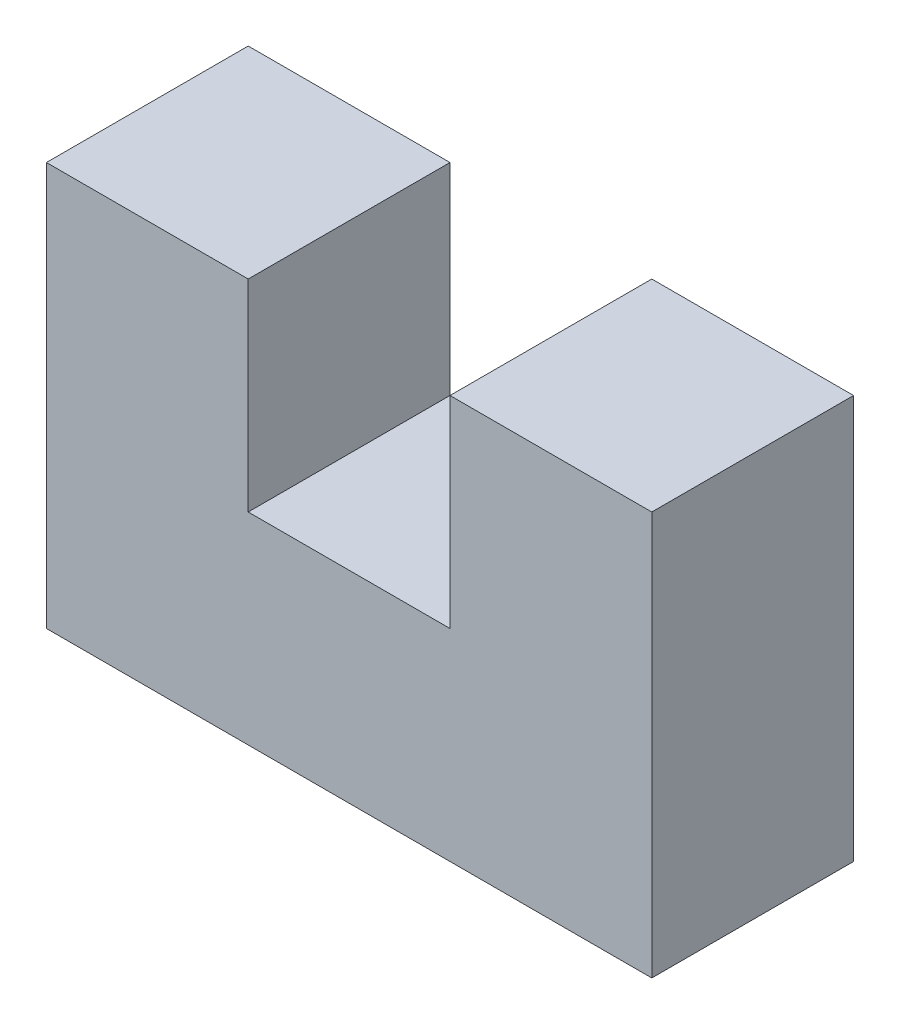
ISO-10303-21;
HEADER;
FILE_DESCRIPTION(('STEP AP214'),'2;1');
FILE_NAME('part.step','',(''),(''),'','','');
FILE_SCHEMA(('AUTOMOTIVE_DESIGN { 1 0 10303 214 1 1 1 1 }'));
ENDSEC;
DATA;
#1=APPLICATION_CONTEXT('core data for automotive mechanical design processes');
#2=APPLICATION_PROTOCOL_DEFINITION('international standard','automotive_design',2000,#1);
#3=PRODUCT_CONTEXT('',#1,'mechanical');
#4=PRODUCT('Part','Part','',(#3));
#5=PRODUCT_RELATED_PRODUCT_CATEGORY('part','',(#4));
#6=PRODUCT_DEFINITION_FORMATION('','',#4);
#7=PRODUCT_DEFINITION_CONTEXT('part definition',#1,'design');
#8=PRODUCT_DEFINITION('design','',#6,#7);
#9=PRODUCT_DEFINITION_SHAPE('','',#8);
#10=(LENGTH_UNIT() NAMED_UNIT(*) SI_UNIT(.MILLI.,.METRE.));
#11=(NAMED_UNIT(*) PLANE_ANGLE_UNIT() SI_UNIT($,.RADIAN.));
#12=(NAMED_UNIT(*) SI_UNIT($,.STERADIAN.) SOLID_ANGLE_UNIT());
#13=UNCERTAINTY_MEASURE_WITH_UNIT(LENGTH_MEASURE(1.E-05),#10,'distance_accuracy_value','');
#14=(GEOMETRIC_REPRESENTATION_CONTEXT(3) GLOBAL_UNCERTAINTY_ASSIGNED_CONTEXT((#13)) GLOBAL_UNIT_ASSIGNED_CONTEXT((#10,
#11,#12)) REPRESENTATION_CONTEXT('',''));
#15=CARTESIAN_POINT('',(0.,0.,0.));
#16=DIRECTION('',(0.,0.,1.));
#17=DIRECTION('',(1.,0.,0.));
#18=AXIS2_PLACEMENT_3D('',#15,#16,#17);
#19=CARTESIAN_POINT('',(25.4,50.8,25.4));
#20=DIRECTION('',(0.,-1.,0.));
#21=DIRECTION('',(0.,0.,-1.));
#22=AXIS2_PLACEMENT_3D('',#19,#20,#21);
#23=PLANE('',#22);
#24=DIRECTION('',(-1.,0.,0.));
#25=VECTOR('',#24,1.);
#26=CARTESIAN_POINT('',(25.4,50.8,0.));
#27=LINE('',#26,#25);
#28=CARTESIAN_POINT('',(25.4,50.8,0.));
#29=VERTEX_POINT('',#28);
#30=CARTESIAN_POINT('',(0.,50.8,0.));
#31=VERTEX_POINT('',#30);
#32=EDGE_CURVE('E133',#29,#31,#27,.T.);
#33=ORIENTED_EDGE('',*,*,#32,.T.);
#34=DIRECTION('',(0.,0.,-1.));
#35=VECTOR('',#34,1.);
#36=CARTESIAN_POINT('',(0.,50.8,25.4));
#37=LINE('',#36,#35);
#38=CARTESIAN_POINT('',(0.,50.8,25.4));
#39=VERTEX_POINT('',#38);
#40=EDGE_CURVE('E11',#39,#31,#37,.T.);
#41=ORIENTED_EDGE('',*,*,#40,.F.);
#42=DIRECTION('',(-1.,0.,0.));
#43=VECTOR('',#42,1.);
#44=CARTESIAN_POINT('',(25.4,50.8,25.4));
#45=LINE('',#44,#43);
#46=CARTESIAN_POINT('',(25.4,50.8,25.4));
#47=VERTEX_POINT('',#46);
#48=EDGE_CURVE('E147',#47,#39,#45,.T.);
#49=ORIENTED_EDGE('',*,*,#48,.F.);
#50=DIRECTION('',(0.,0.,-1.));
#51=VECTOR('',#50,1.);
#52=CARTESIAN_POINT('',(25.4,50.8,25.4));
#53=LINE('',#52,#51);
#54=EDGE_CURVE('E129',#47,#29,#53,.T.);
#55=ORIENTED_EDGE('',*,*,#54,.T.);
#56=EDGE_LOOP('',(#33,#41,#49,#55));
#57=FACE_BOUND('',#56,.T.);
#58=ADVANCED_FACE('F37',(#57),#23,.F.);
#59=CARTESIAN_POINT('',(0.,50.8,25.4));
#60=DIRECTION('',(1.,0.,0.));
#61=DIRECTION('',(0.,0.,-1.));
#62=AXIS2_PLACEMENT_3D('',#59,#60,#61);
#63=PLANE('',#62);
#64=DIRECTION('',(0.,-1.,0.));
#65=VECTOR('',#64,1.);
#66=CARTESIAN_POINT('',(0.,50.8,0.));
#67=LINE('',#66,#65);
#68=CARTESIAN_POINT('',(0.,0.,0.));
#69=VERTEX_POINT('',#68);
#70=EDGE_CURVE('E136',#31,#69,#67,.T.);
#71=ORIENTED_EDGE('',*,*,#70,.T.);
#72=DIRECTION('',(0.,0.,-1.));
#73=VECTOR('',#72,1.);
#74=CARTESIAN_POINT('',(0.,0.,25.4));
#75=LINE('',#74,#73);
#76=CARTESIAN_POINT('',(0.,0.,25.4));
#77=VERTEX_POINT('',#76);
#78=EDGE_CURVE('E45',#77,#69,#75,.T.);
#79=ORIENTED_EDGE('',*,*,#78,.F.);
#80=DIRECTION('',(0.,-1.,0.));
#81=VECTOR('',#80,1.);
#82=CARTESIAN_POINT('',(0.,50.8,25.4));
#83=LINE('',#82,#81);
#84=EDGE_CURVE('E96',#39,#77,#83,.T.);
#85=ORIENTED_EDGE('',*,*,#84,.F.);
#86=ORIENTED_EDGE('',*,*,#40,.T.);
#87=EDGE_LOOP('',(#71,#79,#85,#86));
#88=FACE_BOUND('',#87,.T.);
#89=ADVANCED_FACE('F182',(#88),#63,.F.);
#90=CARTESIAN_POINT('',(0.,0.,25.4));
#91=DIRECTION('',(0.,1.,0.));
#92=DIRECTION('',(0.,0.,1.));
#93=AXIS2_PLACEMENT_3D('',#90,#91,#92);
#94=PLANE('',#93);
#95=DIRECTION('',(1.,0.,0.));
#96=VECTOR('',#95,1.);
#97=CARTESIAN_POINT('',(0.,0.,0.));
#98=LINE('',#97,#96);
#99=CARTESIAN_POINT('',(76.2,0.,0.));
#100=VERTEX_POINT('',#99);
#101=EDGE_CURVE('E138',#69,#100,#98,.T.);
#102=ORIENTED_EDGE('',*,*,#101,.T.);
#103=DIRECTION('',(0.,0.,-1.));
#104=VECTOR('',#103,1.);
#105=CARTESIAN_POINT('',(76.2,0.,25.4));
#106=LINE('',#105,#104);
#107=CARTESIAN_POINT('',(76.2,0.,25.4));
#108=VERTEX_POINT('',#107);
#109=EDGE_CURVE('E154',#108,#100,#106,.T.);
#110=ORIENTED_EDGE('',*,*,#109,.F.);
#111=DIRECTION('',(1.,0.,0.));
#112=VECTOR('',#111,1.);
#113=CARTESIAN_POINT('',(0.,0.,25.4));
#114=LINE('',#113,#112);
#115=EDGE_CURVE('E162',#77,#108,#114,.T.);
#116=ORIENTED_EDGE('',*,*,#115,.F.);
#117=ORIENTED_EDGE('',*,*,#78,.T.);
#118=EDGE_LOOP('',(#102,#110,#116,#117));
#119=FACE_BOUND('',#118,.T.);
#120=ADVANCED_FACE('F160',(#119),#94,.F.);
#121=CARTESIAN_POINT('',(76.2,0.,25.4));
#122=DIRECTION('',(-1.,0.,0.));
#123=DIRECTION('',(0.,0.,1.));
#124=AXIS2_PLACEMENT_3D('',#121,#122,#123);
#125=PLANE('',#124);
#126=DIRECTION('',(0.,1.,0.));
#127=VECTOR('',#126,1.);
#128=CARTESIAN_POINT('',(76.2,0.,0.));
#129=LINE('',#128,#127);
#130=CARTESIAN_POINT('',(76.2,50.8,0.));
#131=VERTEX_POINT('',#130);
#132=EDGE_CURVE('E140',#100,#131,#129,.T.);
#133=ORIENTED_EDGE('',*,*,#132,.T.);
#134=DIRECTION('',(0.,0.,-1.));
#135=VECTOR('',#134,1.);
#136=CARTESIAN_POINT('',(76.2,50.8,25.4));
#137=LINE('',#136,#135);
#138=CARTESIAN_POINT('',(76.2,50.8,25.4));
#139=VERTEX_POINT('',#138);
#140=EDGE_CURVE('E151',#139,#131,#137,.T.);
#141=ORIENTED_EDGE('',*,*,#140,.F.);
#142=DIRECTION('',(0.,1.,0.));
#143=VECTOR('',#142,1.);
#144=CARTESIAN_POINT('',(76.2,0.,25.4));
#145=LINE('',#144,#143);
#146=EDGE_CURVE('E174',#108,#139,#145,.T.);
#147=ORIENTED_EDGE('',*,*,#146,.F.);
#148=ORIENTED_EDGE('',*,*,#109,.T.);
#149=EDGE_LOOP('',(#133,#141,#147,#148));
#150=FACE_BOUND('',#149,.T.);
#151=ADVANCED_FACE('F170',(#150),#125,.F.);
#152=CARTESIAN_POINT('',(76.2,50.8,25.4));
#153=DIRECTION('',(0.,-1.,0.));
#154=DIRECTION('',(0.,0.,-1.));
#155=AXIS2_PLACEMENT_3D('',#152,#153,#154);
#156=PLANE('',#155);
#157=DIRECTION('',(-1.,0.,0.));
#158=VECTOR('',#157,1.);
#159=CARTESIAN_POINT('',(76.2,50.8,0.));
#160=LINE('',#159,#158);
#161=CARTESIAN_POINT('',(50.8,50.8,0.));
#162=VERTEX_POINT('',#161);
#163=EDGE_CURVE('E142',#131,#162,#160,.T.);
#164=ORIENTED_EDGE('',*,*,#163,.T.);
#165=DIRECTION('',(0.,0.,-1.));
#166=VECTOR('',#165,1.);
#167=CARTESIAN_POINT('',(50.8,50.8,25.4));
#168=LINE('',#167,#166);
#169=CARTESIAN_POINT('',(50.8,50.8,25.4));
#170=VERTEX_POINT('',#169);
#171=EDGE_CURVE('E124',#170,#162,#168,.T.);
#172=ORIENTED_EDGE('',*,*,#171,.F.);
#173=DIRECTION('',(-1.,0.,0.));
#174=VECTOR('',#173,1.);
#175=CARTESIAN_POINT('',(76.2,50.8,25.4));
#176=LINE('',#175,#174);
#177=EDGE_CURVE('E115',#139,#170,#176,.T.);
#178=ORIENTED_EDGE('',*,*,#177,.F.);
#179=ORIENTED_EDGE('',*,*,#140,.T.);
#180=EDGE_LOOP('',(#164,#172,#178,#179));
#181=FACE_BOUND('',#180,.T.);
#182=ADVANCED_FACE('F173',(#181),#156,.F.);
#183=CARTESIAN_POINT('',(50.8,50.8,25.4));
#184=DIRECTION('',(1.,0.,0.));
#185=DIRECTION('',(0.,0.,-1.));
#186=AXIS2_PLACEMENT_3D('',#183,#184,#185);
#187=PLANE('',#186);
#188=DIRECTION('',(0.,-1.,0.));
#189=VECTOR('',#188,1.);
#190=CARTESIAN_POINT('',(50.8,50.8,0.));
#191=LINE('',#190,#189);
#192=CARTESIAN_POINT('',(50.8,25.4,0.));
#193=VERTEX_POINT('',#192);
#194=EDGE_CURVE('E123',#162,#193,#191,.T.);
#195=ORIENTED_EDGE('',*,*,#194,.T.);
#196=DIRECTION('',(0.,0.,-1.));
#197=VECTOR('',#196,1.);
#198=CARTESIAN_POINT('',(50.8,25.4,25.4));
#199=LINE('',#198,#197);
#200=CARTESIAN_POINT('',(50.8,25.4,25.4));
#201=VERTEX_POINT('',#200);
#202=EDGE_CURVE('E120',#201,#193,#199,.T.);
#203=ORIENTED_EDGE('',*,*,#202,.F.);
#204=DIRECTION('',(0.,-1.,0.));
#205=VECTOR('',#204,1.);
#206=CARTESIAN_POINT('',(50.8,50.8,25.4));
#207=LINE('',#206,#205);
#208=EDGE_CURVE('E109',#170,#201,#207,.T.);
#209=ORIENTED_EDGE('',*,*,#208,.F.);
#210=ORIENTED_EDGE('',*,*,#171,.T.);
#211=EDGE_LOOP('',(#195,#203,#209,#210));
#212=FACE_BOUND('',#211,.T.);
#213=ADVANCED_FACE('F121',(#212),#187,.F.);
#214=CARTESIAN_POINT('',(50.8,25.4,25.4));
#215=DIRECTION('',(0.,-1.,0.));
#216=DIRECTION('',(0.,0.,-1.));
#217=AXIS2_PLACEMENT_3D('',#214,#215,#216);
#218=PLANE('',#217);
#219=DIRECTION('',(-1.,0.,0.));
#220=VECTOR('',#219,1.);
#221=CARTESIAN_POINT('',(50.8,25.4,0.));
#222=LINE('',#221,#220);
#223=CARTESIAN_POINT('',(25.4,25.4,0.));
#224=VERTEX_POINT('',#223);
#225=EDGE_CURVE('E82',#193,#224,#222,.T.);
#226=ORIENTED_EDGE('',*,*,#225,.T.);
#227=DIRECTION('',(0.,0.,-1.));
#228=VECTOR('',#227,1.);
#229=CARTESIAN_POINT('',(25.4,25.4,25.4));
#230=LINE('',#229,#228);
#231=CARTESIAN_POINT('',(25.4,25.4,25.4));
#232=VERTEX_POINT('',#231);
#233=EDGE_CURVE('E125',#232,#224,#230,.T.);
#234=ORIENTED_EDGE('',*,*,#233,.F.);
#235=DIRECTION('',(-1.,0.,0.));
#236=VECTOR('',#235,1.);
#237=CARTESIAN_POINT('',(50.8,25.4,25.4));
#238=LINE('',#237,#236);
#239=EDGE_CURVE('E113',#201,#232,#238,.T.);
#240=ORIENTED_EDGE('',*,*,#239,.F.);
#241=ORIENTED_EDGE('',*,*,#202,.T.);
#242=EDGE_LOOP('',(#226,#234,#240,#241));
#243=FACE_BOUND('',#242,.T.);
#244=ADVANCED_FACE('F127',(#243),#218,.F.);
#245=CARTESIAN_POINT('',(25.4,25.4,25.4));
#246=DIRECTION('',(-1.,0.,0.));
#247=DIRECTION('',(0.,0.,1.));
#248=AXIS2_PLACEMENT_3D('',#245,#246,#247);
#249=PLANE('',#248);
#250=DIRECTION('',(0.,1.,0.));
#251=VECTOR('',#250,1.);
#252=CARTESIAN_POINT('',(25.4,25.4,0.));
#253=LINE('',#252,#251);
#254=EDGE_CURVE('E88',#224,#29,#253,.T.);
#255=ORIENTED_EDGE('',*,*,#254,.T.);
#256=ORIENTED_EDGE('',*,*,#54,.F.);
#257=DIRECTION('',(0.,1.,0.));
#258=VECTOR('',#257,1.);
#259=CARTESIAN_POINT('',(25.4,25.4,25.4));
#260=LINE('',#259,#258);
#261=EDGE_CURVE('E53',#232,#47,#260,.T.);
#262=ORIENTED_EDGE('',*,*,#261,.F.);
#263=ORIENTED_EDGE('',*,*,#233,.T.);
#264=EDGE_LOOP('',(#255,#256,#262,#263));
#265=FACE_BOUND('',#264,.T.);
#266=ADVANCED_FACE('F198',(#265),#249,.F.);
#267=CARTESIAN_POINT('',(0.,0.,25.4));
#268=DIRECTION('',(0.,0.,1.));
#269=DIRECTION('',(1.,0.,0.));
#270=AXIS2_PLACEMENT_3D('',#267,#268,#269);
#271=PLANE('',#270);
#272=ORIENTED_EDGE('',*,*,#48,.T.);
#273=ORIENTED_EDGE('',*,*,#84,.T.);
#274=ORIENTED_EDGE('',*,*,#115,.T.);
#275=ORIENTED_EDGE('',*,*,#146,.T.);
#276=ORIENTED_EDGE('',*,*,#177,.T.);
#277=ORIENTED_EDGE('',*,*,#208,.T.);
#278=ORIENTED_EDGE('',*,*,#239,.T.);
#279=ORIENTED_EDGE('',*,*,#261,.T.);
#280=EDGE_LOOP('',(#272,#273,#274,#275,#276,#277,#278,#279));
#281=FACE_BOUND('',#280,.T.);
#282=ADVANCED_FACE('F111',(#281),#271,.T.);
#283=CARTESIAN_POINT('',(0.,0.,0.));
#284=DIRECTION('',(0.,0.,1.));
#285=DIRECTION('',(1.,0.,0.));
#286=AXIS2_PLACEMENT_3D('',#283,#284,#285);
#287=PLANE('',#286);
#288=ORIENTED_EDGE('',*,*,#32,.F.);
#289=ORIENTED_EDGE('',*,*,#254,.F.);
#290=ORIENTED_EDGE('',*,*,#225,.F.);
#291=ORIENTED_EDGE('',*,*,#194,.F.);
#292=ORIENTED_EDGE('',*,*,#163,.F.);
#293=ORIENTED_EDGE('',*,*,#132,.F.);
#294=ORIENTED_EDGE('',*,*,#101,.F.);
#295=ORIENTED_EDGE('',*,*,#70,.F.);
#296=EDGE_LOOP('',(#288,#289,#290,#291,#292,#293,#294,#295));
#297=FACE_BOUND('',#296,.T.);
#298=ADVANCED_FACE('F166',(#297),#287,.F.);
#299=CLOSED_SHELL('',(#58,#89,#120,#151,#182,#213,#244,#266,#282,#298));
#300=MANIFOLD_SOLID_BREP('B2',#299);
#301=ADVANCED_BREP_SHAPE_REPRESENTATION('',(#18,#300),#14);
#302=SHAPE_DEFINITION_REPRESENTATION(#9,#301);
ENDSEC;
END-ISO-10303-21;
